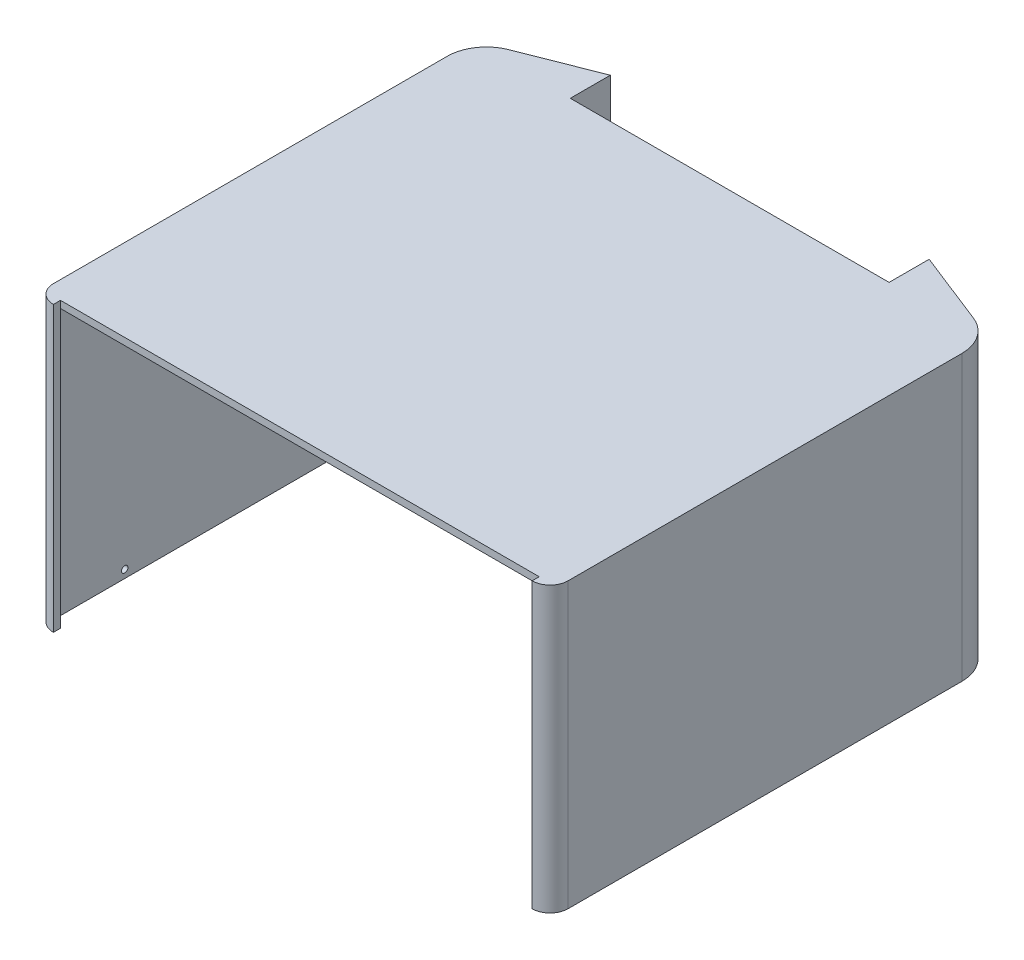
ISO-10303-21;
HEADER;
FILE_DESCRIPTION(('STEP AP214'),'2;1');
FILE_NAME('part.step','',(''),(''),'','','');
FILE_SCHEMA(('AUTOMOTIVE_DESIGN { 1 0 10303 214 1 1 1 1 }'));
ENDSEC;
DATA;
#1=APPLICATION_CONTEXT('core data for automotive mechanical design processes');
#2=APPLICATION_PROTOCOL_DEFINITION('international standard','automotive_design',2000,#1);
#3=PRODUCT_CONTEXT('',#1,'mechanical');
#4=PRODUCT('Part','Part','',(#3));
#5=PRODUCT_RELATED_PRODUCT_CATEGORY('part','',(#4));
#6=PRODUCT_DEFINITION_FORMATION('','',#4);
#7=PRODUCT_DEFINITION_CONTEXT('part definition',#1,'design');
#8=PRODUCT_DEFINITION('design','',#6,#7);
#9=PRODUCT_DEFINITION_SHAPE('','',#8);
#10=(LENGTH_UNIT() NAMED_UNIT(*) SI_UNIT(.MILLI.,.METRE.));
#11=(NAMED_UNIT(*) PLANE_ANGLE_UNIT() SI_UNIT($,.RADIAN.));
#12=(NAMED_UNIT(*) SI_UNIT($,.STERADIAN.) SOLID_ANGLE_UNIT());
#13=UNCERTAINTY_MEASURE_WITH_UNIT(LENGTH_MEASURE(1.E-05),#10,'distance_accuracy_value','');
#14=(GEOMETRIC_REPRESENTATION_CONTEXT(3) GLOBAL_UNCERTAINTY_ASSIGNED_CONTEXT((#13)) GLOBAL_UNIT_ASSIGNED_CONTEXT((#10,
#11,#12)) REPRESENTATION_CONTEXT('',''));
#15=CARTESIAN_POINT('',(0.,0.,0.));
#16=DIRECTION('',(0.,0.,1.));
#17=DIRECTION('',(1.,0.,0.));
#18=AXIS2_PLACEMENT_3D('',#15,#16,#17);
#19=CARTESIAN_POINT('',(67.4563231951163,86.2,-53.2130388353289));
#20=DIRECTION('',(0.,-1.,0.));
#21=DIRECTION('',(0.,0.,-1.));
#22=AXIS2_PLACEMENT_3D('',#19,#20,#21);
#23=PLANE('',#22);
#24=DIRECTION('',(0.,0.,-1.));
#25=VECTOR('',#24,1.);
#26=CARTESIAN_POINT('',(-52.2594055574218,86.2,-59.6605386585272));
#27=LINE('',#26,#25);
#28=CARTESIAN_POINT('',(-52.2594055574218,86.2,-59.6605386585272));
#29=VERTEX_POINT('',#28);
#30=CARTESIAN_POINT('',(-52.2594055574218,86.2,-70.2901322169009));
#31=VERTEX_POINT('',#30);
#32=EDGE_CURVE('E238',#29,#31,#27,.T.);
#33=ORIENTED_EDGE('',*,*,#32,.F.);
#34=DIRECTION('',(1.,0.,0.));
#35=VECTOR('',#34,1.);
#36=CARTESIAN_POINT('',(-51.4594055574218,86.2,-59.6605386585272));
#37=LINE('',#36,#35);
#38=CARTESIAN_POINT('',(50.5720519476544,86.2,-59.6605386585272));
#39=VERTEX_POINT('',#38);
#40=EDGE_CURVE('E64',#29,#39,#37,.T.);
#41=ORIENTED_EDGE('',*,*,#40,.T.);
#42=DIRECTION('',(0.,0.,-1.));
#43=VECTOR('',#42,1.);
#44=CARTESIAN_POINT('',(50.5720519476544,86.2,-59.6605386585272));
#45=LINE('',#44,#43);
#46=CARTESIAN_POINT('',(50.5720519476544,86.2,-70.6049959841991));
#47=VERTEX_POINT('',#46);
#48=EDGE_CURVE('E246',#39,#47,#45,.T.);
#49=ORIENTED_EDGE('',*,*,#48,.T.);
#50=DIRECTION('',(0.930522484488547,0.,0.366234768777162));
#51=VECTOR('',#50,1.);
#52=CARTESIAN_POINT('',(50.5720519476544,86.2,-70.6049959841991));
#53=LINE('',#52,#51);
#54=CARTESIAN_POINT('',(71.1186708828879,86.2,-62.5182636802143));
#55=VERTEX_POINT('',#54);
#56=EDGE_CURVE('E248',#47,#55,#53,.T.);
#57=ORIENTED_EDGE('',*,*,#56,.T.);
#58=CARTESIAN_POINT('',(67.4563231951163,86.2,-53.2130388353289));
#59=DIRECTION('',(0.,-1.,0.));
#60=DIRECTION('',(0.,0.,-1.));
#61=AXIS2_PLACEMENT_3D('',#58,#59,#60);
#62=CIRCLE('',#61,9.99999999999995);
#63=CARTESIAN_POINT('',(77.4563231951162,86.2,-53.2130388353289));
#64=VERTEX_POINT('',#63);
#65=EDGE_CURVE('E250',#55,#64,#62,.T.);
#66=ORIENTED_EDGE('',*,*,#65,.T.);
#67=DIRECTION('',(0.,0.,1.));
#68=VECTOR('',#67,1.);
#69=CARTESIAN_POINT('',(77.4563231951162,86.2,-53.2130388353289));
#70=LINE('',#69,#68);
#71=CARTESIAN_POINT('',(77.4563231951163,86.2,69.3394613414728));
#72=VERTEX_POINT('',#71);
#73=EDGE_CURVE('E252',#64,#72,#70,.T.);
#74=ORIENTED_EDGE('',*,*,#73,.T.);
#75=CARTESIAN_POINT('',(74.0563231951163,86.2,69.3394613414728));
#76=DIRECTION('',(0.,-1.,0.));
#77=DIRECTION('',(0.,0.,-1.));
#78=AXIS2_PLACEMENT_3D('',#75,#76,#77);
#79=CIRCLE('',#78,3.39999999999999);
#80=CARTESIAN_POINT('',(74.0563231951163,86.2,72.7394613414728));
#81=VERTEX_POINT('',#80);
#82=EDGE_CURVE('E254',#72,#81,#79,.T.);
#83=ORIENTED_EDGE('',*,*,#82,.T.);
#84=DIRECTION('',(-1.,0.,0.));
#85=VECTOR('',#84,1.);
#86=CARTESIAN_POINT('',(74.0563231951163,86.2,72.7394613414728));
#87=LINE('',#86,#85);
#88=CARTESIAN_POINT('',(-74.9436768048837,86.2,72.7394613414728));
#89=VERTEX_POINT('',#88);
#90=EDGE_CURVE('E257',#81,#89,#87,.T.);
#91=ORIENTED_EDGE('',*,*,#90,.T.);
#92=CARTESIAN_POINT('',(-74.9436768048837,86.2,69.3394613414728));
#93=DIRECTION('',(0.,-1.,0.));
#94=DIRECTION('',(0.,0.,-1.));
#95=AXIS2_PLACEMENT_3D('',#92,#93,#94);
#96=CIRCLE('',#95,3.4);
#97=CARTESIAN_POINT('',(-78.3436768048837,86.2,69.3394613414728));
#98=VERTEX_POINT('',#97);
#99=EDGE_CURVE('E259',#89,#98,#96,.T.);
#100=ORIENTED_EDGE('',*,*,#99,.T.);
#101=DIRECTION('',(0.,0.,-1.));
#102=VECTOR('',#101,1.);
#103=CARTESIAN_POINT('',(-78.3436768048837,86.2,69.3394613414728));
#104=LINE('',#103,#102);
#105=CARTESIAN_POINT('',(-78.3436768048837,86.2,-53.2130388353288));
#106=VERTEX_POINT('',#105);
#107=EDGE_CURVE('E261',#98,#106,#104,.T.);
#108=ORIENTED_EDGE('',*,*,#107,.T.);
#109=CARTESIAN_POINT('',(-68.3436768048837,86.2,-53.2130388353289));
#110=DIRECTION('',(0.,-1.,0.));
#111=DIRECTION('',(0.,0.,-1.));
#112=AXIS2_PLACEMENT_3D('',#109,#110,#111);
#113=CIRCLE('',#112,10.);
#114=CARTESIAN_POINT('',(-72.0060244926553,86.2,-62.5182636802143));
#115=VERTEX_POINT('',#114);
#116=EDGE_CURVE('E263',#106,#115,#113,.T.);
#117=ORIENTED_EDGE('',*,*,#116,.T.);
#118=DIRECTION('',(0.930522484488548,0.,-0.36623476877716));
#119=VECTOR('',#118,1.);
#120=CARTESIAN_POINT('',(-72.0060244926553,86.2,-62.5182636802143));
#121=LINE('',#120,#119);
#122=EDGE_CURVE('E265',#115,#31,#121,.T.);
#123=ORIENTED_EDGE('',*,*,#122,.T.);
#124=EDGE_LOOP('',(#33,#41,#49,#57,#66,#74,#83,#91,#100,#108,#117,#123));
#125=FACE_BOUND('',#124,.T.);
#126=ADVANCED_FACE('F39',(#125),#23,.T.);
#127=CARTESIAN_POINT('',(-50.0594055574218,82.,0.));
#128=DIRECTION('',(-1.,0.,0.));
#129=DIRECTION('',(0.,0.,1.));
#130=AXIS2_PLACEMENT_3D('',#127,#128,#129);
#131=PLANE('',#130);
#132=DIRECTION('',(0.,0.,1.));
#133=VECTOR('',#132,1.);
#134=CARTESIAN_POINT('',(-50.0594055574218,81.6600000000001,-61.0605386585292));
#135=LINE('',#134,#133);
#136=CARTESIAN_POINT('',(-50.0594055574218,81.6600000000001,-61.0605386585292));
#137=VERTEX_POINT('',#136);
#138=CARTESIAN_POINT('',(-50.0594055574218,81.6600000000001,-59.6605386585292));
#139=VERTEX_POINT('',#138);
#140=EDGE_CURVE('E354',#137,#139,#135,.T.);
#141=ORIENTED_EDGE('',*,*,#140,.T.);
#142=DIRECTION('',(0.,-1.,0.));
#143=VECTOR('',#142,1.);
#144=CARTESIAN_POINT('',(-50.0594055574218,96.9,-59.6605386585272));
#145=LINE('',#144,#143);
#146=CARTESIAN_POINT('',(-50.0594055574218,0.,-59.6605386585272));
#147=VERTEX_POINT('',#146);
#148=EDGE_CURVE('E43',#139,#147,#145,.T.);
#149=ORIENTED_EDGE('',*,*,#148,.T.);
#150=DIRECTION('',(0.,0.,-1.));
#151=VECTOR('',#150,1.);
#152=CARTESIAN_POINT('',(-50.0594055574218,0.,0.));
#153=LINE('',#152,#151);
#154=CARTESIAN_POINT('',(-50.0594055574218,0.,-73.5202707051308));
#155=VERTEX_POINT('',#154);
#156=EDGE_CURVE('E227',#147,#155,#153,.T.);
#157=ORIENTED_EDGE('',*,*,#156,.T.);
#158=DIRECTION('',(0.,1.,0.));
#159=VECTOR('',#158,1.);
#160=CARTESIAN_POINT('',(-50.0594055574218,-151.557193273161,-73.5202707051308));
#161=LINE('',#160,#159);
#162=CARTESIAN_POINT('',(-50.0594055574218,88.4,-73.5202707051308));
#163=VERTEX_POINT('',#162);
#164=EDGE_CURVE('E291',#155,#163,#161,.T.);
#165=ORIENTED_EDGE('',*,*,#164,.T.);
#166=DIRECTION('',(0.,0.,-1.));
#167=VECTOR('',#166,1.);
#168=CARTESIAN_POINT('',(-50.0594055574218,88.4,0.));
#169=LINE('',#168,#167);
#170=CARTESIAN_POINT('',(-50.0594055574218,88.4,-61.0605386585292));
#171=VERTEX_POINT('',#170);
#172=EDGE_CURVE('E403',#171,#163,#169,.T.);
#173=ORIENTED_EDGE('',*,*,#172,.F.);
#174=DIRECTION('',(0.,-1.,0.));
#175=VECTOR('',#174,1.);
#176=CARTESIAN_POINT('',(-50.0594055574218,0.,-61.0605386585292));
#177=LINE('',#176,#175);
#178=EDGE_CURVE('E345',#171,#137,#177,.T.);
#179=ORIENTED_EDGE('',*,*,#178,.T.);
#180=EDGE_LOOP('',(#141,#149,#157,#165,#173,#179));
#181=FACE_BOUND('',#180,.T.);
#182=ADVANCED_FACE('F462',(#181),#131,.F.);
#183=CARTESIAN_POINT('',(49.1720519476544,88.4,0.));
#184=DIRECTION('',(1.,0.,0.));
#185=DIRECTION('',(0.,0.,-1.));
#186=AXIS2_PLACEMENT_3D('',#183,#184,#185);
#187=PLANE('',#186);
#188=DIRECTION('',(0.,0.,1.));
#189=VECTOR('',#188,1.);
#190=CARTESIAN_POINT('',(49.1720519476541,81.66,-61.0605386585272));
#191=LINE('',#190,#189);
#192=CARTESIAN_POINT('',(49.1720519476541,81.66,-61.0605386585272));
#193=VERTEX_POINT('',#192);
#194=CARTESIAN_POINT('',(49.1720519476544,81.66,-59.6605386585272));
#195=VERTEX_POINT('',#194);
#196=EDGE_CURVE('E358',#193,#195,#191,.T.);
#197=ORIENTED_EDGE('',*,*,#196,.F.);
#198=DIRECTION('',(0.,-1.,0.));
#199=VECTOR('',#198,1.);
#200=CARTESIAN_POINT('',(49.1720519476509,-1.92367756039792E-12,-61.0605386585272));
#201=LINE('',#200,#199);
#202=CARTESIAN_POINT('',(49.1720519476544,88.4,-61.0605386585272));
#203=VERTEX_POINT('',#202);
#204=EDGE_CURVE('E350',#203,#193,#201,.T.);
#205=ORIENTED_EDGE('',*,*,#204,.F.);
#206=DIRECTION('',(0.,0.,1.));
#207=VECTOR('',#206,1.);
#208=CARTESIAN_POINT('',(49.1720519476544,88.4,0.));
#209=LINE('',#208,#207);
#210=CARTESIAN_POINT('',(49.1720519476544,88.4,-73.5202707051308));
#211=VERTEX_POINT('',#210);
#212=EDGE_CURVE('E413',#211,#203,#209,.T.);
#213=ORIENTED_EDGE('',*,*,#212,.F.);
#214=DIRECTION('',(0.,1.,0.));
#215=VECTOR('',#214,1.);
#216=CARTESIAN_POINT('',(49.1720519476544,-151.557193273161,-73.5202707051308));
#217=LINE('',#216,#215);
#218=CARTESIAN_POINT('',(49.1720519476544,0.,-73.5202707051308));
#219=VERTEX_POINT('',#218);
#220=EDGE_CURVE('E331',#219,#211,#217,.T.);
#221=ORIENTED_EDGE('',*,*,#220,.F.);
#222=DIRECTION('',(0.,0.,-1.));
#223=VECTOR('',#222,1.);
#224=CARTESIAN_POINT('',(49.1720519476544,0.,0.));
#225=LINE('',#224,#223);
#226=CARTESIAN_POINT('',(49.1720519476544,0.,-59.6605386585272));
#227=VERTEX_POINT('',#226);
#228=EDGE_CURVE('E375',#227,#219,#225,.T.);
#229=ORIENTED_EDGE('',*,*,#228,.F.);
#230=DIRECTION('',(0.,-1.,0.));
#231=VECTOR('',#230,1.);
#232=CARTESIAN_POINT('',(49.1720519476544,82.,-59.6605386585272));
#233=LINE('',#232,#231);
#234=EDGE_CURVE('E397',#195,#227,#233,.T.);
#235=ORIENTED_EDGE('',*,*,#234,.F.);
#236=EDGE_LOOP('',(#197,#205,#213,#221,#229,#235));
#237=FACE_BOUND('',#236,.T.);
#238=ADVANCED_FACE('F468',(#237),#187,.F.);
#239=CARTESIAN_POINT('',(0.,0.,0.));
#240=DIRECTION('',(0.,1.,0.));
#241=DIRECTION('',(0.,0.,1.));
#242=AXIS2_PLACEMENT_3D('',#239,#240,#241);
#243=PLANE('',#242);
#244=DIRECTION('',(0.,0.,1.));
#245=VECTOR('',#244,1.);
#246=CARTESIAN_POINT('',(-52.2594055574218,0.,-70.6049959841991));
#247=LINE('',#246,#245);
#248=CARTESIAN_POINT('',(-52.2594055574218,0.,-70.2901322169009));
#249=VERTEX_POINT('',#248);
#250=CARTESIAN_POINT('',(-52.2594055574218,0.,-59.6605386585272));
#251=VERTEX_POINT('',#250);
#252=EDGE_CURVE('E225',#249,#251,#247,.T.);
#253=ORIENTED_EDGE('',*,*,#252,.F.);
#254=DIRECTION('',(0.930522484488547,0.,-0.366234768777162));
#255=VECTOR('',#254,1.);
#256=CARTESIAN_POINT('',(-30.9635967827457,0.,-78.6717304399712));
#257=LINE('',#256,#255);
#258=CARTESIAN_POINT('',(-72.0060244926553,0.,-62.5182636802143));
#259=VERTEX_POINT('',#258);
#260=EDGE_CURVE('E56',#259,#249,#257,.T.);
#261=ORIENTED_EDGE('',*,*,#260,.F.);
#262=CARTESIAN_POINT('',(-68.3436768048837,0.,-53.2130388353289));
#263=DIRECTION('',(0.,1.,0.));
#264=DIRECTION('',(0.,0.,1.));
#265=AXIS2_PLACEMENT_3D('',#262,#263,#264);
#266=CIRCLE('',#265,9.99999999999998);
#267=CARTESIAN_POINT('',(-78.3436768048837,0.,-53.2130388353288));
#268=VERTEX_POINT('',#267);
#269=EDGE_CURVE('E427',#268,#259,#266,.F.);
#270=ORIENTED_EDGE('',*,*,#269,.F.);
#271=DIRECTION('',(0.,0.,1.));
#272=VECTOR('',#271,1.);
#273=CARTESIAN_POINT('',(-78.3436768048837,0.,0.));
#274=LINE('',#273,#272);
#275=CARTESIAN_POINT('',(-78.3436768048837,0.,69.3394613414728));
#276=VERTEX_POINT('',#275);
#277=EDGE_CURVE('E229',#268,#276,#274,.T.);
#278=ORIENTED_EDGE('',*,*,#277,.T.);
#279=CARTESIAN_POINT('',(-74.9436768048837,0.,69.3394613414728));
#280=DIRECTION('',(0.,1.,0.));
#281=DIRECTION('',(0.,0.,1.));
#282=AXIS2_PLACEMENT_3D('',#279,#280,#281);
#283=CIRCLE('',#282,3.4);
#284=CARTESIAN_POINT('',(-74.9436768048837,0.,72.7394613414728));
#285=VERTEX_POINT('',#284);
#286=EDGE_CURVE('E418',#276,#285,#283,.T.);
#287=ORIENTED_EDGE('',*,*,#286,.T.);
#288=DIRECTION('',(0.,0.,1.));
#289=VECTOR('',#288,1.);
#290=CARTESIAN_POINT('',(-74.9436768048837,0.,72.6394613414728));
#291=LINE('',#290,#289);
#292=CARTESIAN_POINT('',(-74.9436768048837,0.,74.9394613414728));
#293=VERTEX_POINT('',#292);
#294=EDGE_CURVE('E230',#285,#293,#291,.T.);
#295=ORIENTED_EDGE('',*,*,#294,.T.);
#296=CARTESIAN_POINT('',(-74.9436768048837,0.,69.3394613414728));
#297=DIRECTION('',(0.,1.,0.));
#298=DIRECTION('',(0.,0.,1.));
#299=AXIS2_PLACEMENT_3D('',#296,#297,#298);
#300=CIRCLE('',#299,5.6);
#301=CARTESIAN_POINT('',(-80.5436768048837,0.,69.3394613414728));
#302=VERTEX_POINT('',#301);
#303=EDGE_CURVE('E275',#293,#302,#300,.F.);
#304=ORIENTED_EDGE('',*,*,#303,.T.);
#305=DIRECTION('',(0.,0.,-1.));
#306=VECTOR('',#305,1.);
#307=CARTESIAN_POINT('',(-80.5436768048837,0.,0.));
#308=LINE('',#307,#306);
#309=CARTESIAN_POINT('',(-80.5436768048837,0.,-53.2130388353288));
#310=VERTEX_POINT('',#309);
#311=EDGE_CURVE('E273',#302,#310,#308,.T.);
#312=ORIENTED_EDGE('',*,*,#311,.T.);
#313=CARTESIAN_POINT('',(-68.3436768048837,0.,-53.2130388353289));
#314=DIRECTION('',(0.,1.,0.));
#315=DIRECTION('',(0.,0.,1.));
#316=AXIS2_PLACEMENT_3D('',#313,#314,#315);
#317=CIRCLE('',#316,12.2);
#318=CARTESIAN_POINT('',(-72.8117409839651,0.,-64.5654131460891));
#319=VERTEX_POINT('',#318);
#320=EDGE_CURVE('E270',#310,#319,#317,.F.);
#321=ORIENTED_EDGE('',*,*,#320,.T.);
#322=DIRECTION('',(0.930522484488548,0.,-0.366234768777161));
#323=VECTOR('',#322,1.);
#324=CARTESIAN_POINT('',(-31.7693132740553,0.,-80.718879905846));
#325=LINE('',#324,#323);
#326=EDGE_CURVE('E268',#319,#155,#325,.T.);
#327=ORIENTED_EDGE('',*,*,#326,.T.);
#328=ORIENTED_EDGE('',*,*,#156,.F.);
#329=DIRECTION('',(-1.,0.,0.));
#330=VECTOR('',#329,1.);
#331=CARTESIAN_POINT('',(0.,0.,-59.6605386585272));
#332=LINE('',#331,#330);
#333=EDGE_CURVE('E223',#147,#251,#332,.T.);
#334=ORIENTED_EDGE('',*,*,#333,.T.);
#335=EDGE_LOOP('',(#253,#261,#270,#278,#287,#295,#304,#312,#321,#327,#328,#334));
#336=FACE_BOUND('',#335,.T.);
#337=ADVANCED_FACE('F41',(#336),#243,.F.);
#338=CARTESIAN_POINT('',(-74.9436768048837,82.,69.3394613414728));
#339=DIRECTION('',(0.,-1.,0.));
#340=DIRECTION('',(0.,0.,-1.));
#341=AXIS2_PLACEMENT_3D('',#338,#339,#340);
#342=CYLINDRICAL_SURFACE('',#341,3.4);
#343=ORIENTED_EDGE('',*,*,#99,.F.);
#344=DIRECTION('',(0.,-1.,0.));
#345=VECTOR('',#344,1.);
#346=CARTESIAN_POINT('',(-74.9436768048837,82.,72.7394613414728));
#347=LINE('',#346,#345);
#348=EDGE_CURVE('E423',#89,#285,#347,.T.);
#349=ORIENTED_EDGE('',*,*,#348,.T.);
#350=ORIENTED_EDGE('',*,*,#286,.F.);
#351=DIRECTION('',(0.,-1.,0.));
#352=VECTOR('',#351,1.);
#353=CARTESIAN_POINT('',(-78.3436768048837,82.,69.3394613414728));
#354=LINE('',#353,#352);
#355=EDGE_CURVE('E422',#98,#276,#354,.T.);
#356=ORIENTED_EDGE('',*,*,#355,.F.);
#357=EDGE_LOOP('',(#343,#349,#350,#356));
#358=FACE_BOUND('',#357,.T.);
#359=ADVANCED_FACE('F447',(#358),#342,.F.);
#360=CARTESIAN_POINT('',(-78.3436768048837,82.,0.));
#361=DIRECTION('',(1.,0.,0.));
#362=DIRECTION('',(0.,0.,-1.));
#363=AXIS2_PLACEMENT_3D('',#360,#361,#362);
#364=PLANE('',#363);
#365=ORIENTED_EDGE('',*,*,#107,.F.);
#366=ORIENTED_EDGE('',*,*,#355,.T.);
#367=ORIENTED_EDGE('',*,*,#277,.F.);
#368=DIRECTION('',(0.,-1.,0.));
#369=VECTOR('',#368,1.);
#370=CARTESIAN_POINT('',(-78.3436768048837,82.,-53.2130388353288));
#371=LINE('',#370,#369);
#372=EDGE_CURVE('E425',#106,#268,#371,.T.);
#373=ORIENTED_EDGE('',*,*,#372,.F.);
#374=EDGE_LOOP('',(#365,#366,#367,#373));
#375=FACE_BOUND('',#374,.T.);
#376=CARTESIAN_POINT('',(-78.3436768048837,2.5,-33.2130388353288));
#377=DIRECTION('',(1.,0.,0.));
#378=DIRECTION('',(0.,0.,-1.));
#379=AXIS2_PLACEMENT_3D('',#376,#377,#378);
#380=CIRCLE('',#379,0.999999999999998);
#381=CARTESIAN_POINT('',(-78.3436768048837,2.5,-34.2130388353288));
#382=VERTEX_POINT('',#381);
#383=EDGE_CURVE('E11',#382,#382,#380,.T.);
#384=ORIENTED_EDGE('',*,*,#383,.F.);
#385=EDGE_LOOP('',(#384));
#386=FACE_BOUND('',#385,.T.);
#387=CARTESIAN_POINT('',(-78.3436768048837,2.5,49.3394613414728));
#388=DIRECTION('',(1.,0.,0.));
#389=DIRECTION('',(0.,0.,-1.));
#390=AXIS2_PLACEMENT_3D('',#387,#388,#389);
#391=CIRCLE('',#390,0.999999999999998);
#392=CARTESIAN_POINT('',(-78.3436768048837,2.5,48.3394613414728));
#393=VERTEX_POINT('',#392);
#394=EDGE_CURVE('E48',#393,#393,#391,.T.);
#395=ORIENTED_EDGE('',*,*,#394,.F.);
#396=EDGE_LOOP('',(#395));
#397=FACE_BOUND('',#396,.T.);
#398=ADVANCED_FACE('F444',(#375,#386,#397),#364,.T.);
#399=CARTESIAN_POINT('',(-68.3436768048837,82.,-53.2130388353289));
#400=DIRECTION('',(0.,-1.,0.));
#401=DIRECTION('',(0.,0.,-1.));
#402=AXIS2_PLACEMENT_3D('',#399,#400,#401);
#403=CYLINDRICAL_SURFACE('',#402,9.99999999999998);
#404=DIRECTION('',(0.,-1.,0.));
#405=VECTOR('',#404,1.);
#406=CARTESIAN_POINT('',(-72.0060244926553,82.,-62.5182636802143));
#407=LINE('',#406,#405);
#408=EDGE_CURVE('E428',#115,#259,#407,.T.);
#409=ORIENTED_EDGE('',*,*,#408,.F.);
#410=ORIENTED_EDGE('',*,*,#116,.F.);
#411=ORIENTED_EDGE('',*,*,#372,.T.);
#412=ORIENTED_EDGE('',*,*,#269,.T.);
#413=EDGE_LOOP('',(#409,#410,#411,#412));
#414=FACE_BOUND('',#413,.T.);
#415=ADVANCED_FACE('F446',(#414),#403,.F.);
#416=CARTESIAN_POINT('',(-30.9635967827457,82.,-78.6717304399712));
#417=DIRECTION('',(-0.366234768777162,0.,-0.930522484488547));
#418=DIRECTION('',(-0.930522484488547,0.,0.366234768777162));
#419=AXIS2_PLACEMENT_3D('',#416,#417,#418);
#420=PLANE('',#419);
#421=ORIENTED_EDGE('',*,*,#260,.T.);
#422=DIRECTION('',(0.,1.,0.));
#423=VECTOR('',#422,1.);
#424=CARTESIAN_POINT('',(-52.2594055574218,82.,-70.2901322169009));
#425=LINE('',#424,#423);
#426=EDGE_CURVE('E237',#249,#31,#425,.T.);
#427=ORIENTED_EDGE('',*,*,#426,.T.);
#428=ORIENTED_EDGE('',*,*,#122,.F.);
#429=ORIENTED_EDGE('',*,*,#408,.T.);
#430=EDGE_LOOP('',(#421,#427,#428,#429));
#431=FACE_BOUND('',#430,.T.);
#432=ADVANCED_FACE('F454',(#431),#420,.F.);
#433=CARTESIAN_POINT('',(0.,82.,-59.6605386585272));
#434=DIRECTION('',(0.,0.,1.));
#435=DIRECTION('',(1.,0.,0.));
#436=AXIS2_PLACEMENT_3D('',#433,#434,#435);
#437=PLANE('',#436);
#438=ORIENTED_EDGE('',*,*,#40,.F.);
#439=DIRECTION('',(0.,1.,0.));
#440=VECTOR('',#439,1.);
#441=CARTESIAN_POINT('',(-52.2594055574218,0.,-59.6605386585272));
#442=LINE('',#441,#440);
#443=EDGE_CURVE('E236',#251,#29,#442,.T.);
#444=ORIENTED_EDGE('',*,*,#443,.F.);
#445=ORIENTED_EDGE('',*,*,#333,.F.);
#446=ORIENTED_EDGE('',*,*,#148,.F.);
#447=DIRECTION('',(-1.,0.,0.));
#448=VECTOR('',#447,1.);
#449=CARTESIAN_POINT('',(1.21471754603014E-12,81.66,-59.6605386585282));
#450=LINE('',#449,#448);
#451=EDGE_CURVE('E344',#195,#139,#450,.T.);
#452=ORIENTED_EDGE('',*,*,#451,.F.);
#453=ORIENTED_EDGE('',*,*,#234,.T.);
#454=DIRECTION('',(1.,0.,0.));
#455=VECTOR('',#454,1.);
#456=CARTESIAN_POINT('',(0.,0.,-59.6605386585272));
#457=LINE('',#456,#455);
#458=CARTESIAN_POINT('',(50.5720519476544,0.,-59.6605386585272));
#459=VERTEX_POINT('',#458);
#460=EDGE_CURVE('E377',#227,#459,#457,.T.);
#461=ORIENTED_EDGE('',*,*,#460,.T.);
#462=DIRECTION('',(0.,-1.,0.));
#463=VECTOR('',#462,1.);
#464=CARTESIAN_POINT('',(50.5720519476544,82.,-59.6605386585272));
#465=LINE('',#464,#463);
#466=EDGE_CURVE('E395',#39,#459,#465,.T.);
#467=ORIENTED_EDGE('',*,*,#466,.F.);
#468=EDGE_LOOP('',(#438,#444,#445,#446,#452,#453,#461,#467));
#469=FACE_BOUND('',#468,.T.);
#470=ADVANCED_FACE('F240',(#469),#437,.T.);
#471=CARTESIAN_POINT('',(-74.9436768048837,82.,72.6394613414728));
#472=DIRECTION('',(-1.,0.,0.));
#473=DIRECTION('',(0.,0.,1.));
#474=AXIS2_PLACEMENT_3D('',#471,#472,#473);
#475=PLANE('',#474);
#476=CARTESIAN_POINT('',(-74.9436768048837,88.4,72.7394613414728));
#477=VERTEX_POINT('',#476);
#478=EDGE_CURVE('E419',#477,#89,#347,.T.);
#479=ORIENTED_EDGE('',*,*,#478,.F.);
#480=DIRECTION('',(0.,0.,-1.));
#481=VECTOR('',#480,1.);
#482=CARTESIAN_POINT('',(-74.9436768048837,88.4,0.));
#483=LINE('',#482,#481);
#484=CARTESIAN_POINT('',(-74.9436768048837,88.4,74.9394613414728));
#485=VERTEX_POINT('',#484);
#486=EDGE_CURVE('E405',#485,#477,#483,.T.);
#487=ORIENTED_EDGE('',*,*,#486,.F.);
#488=DIRECTION('',(0.,1.,0.));
#489=VECTOR('',#488,1.);
#490=CARTESIAN_POINT('',(-74.9436768048837,-151.557193273161,74.9394613414728));
#491=LINE('',#490,#489);
#492=EDGE_CURVE('E294',#293,#485,#491,.T.);
#493=ORIENTED_EDGE('',*,*,#492,.F.);
#494=ORIENTED_EDGE('',*,*,#294,.F.);
#495=ORIENTED_EDGE('',*,*,#348,.F.);
#496=EDGE_LOOP('',(#479,#487,#493,#494,#495));
#497=FACE_BOUND('',#496,.T.);
#498=ADVANCED_FACE('F581',(#497),#475,.F.);
#499=CARTESIAN_POINT('',(163.256323195116,2.5,49.3394613414728));
#500=DIRECTION('',(-1.,0.,0.));
#501=DIRECTION('',(0.,0.,1.));
#502=AXIS2_PLACEMENT_3D('',#499,#500,#501);
#503=CYLINDRICAL_SURFACE('',#502,0.999999999999998);
#504=ORIENTED_EDGE('',*,*,#394,.T.);
#505=EDGE_LOOP('',(#504));
#506=FACE_BOUND('',#505,.T.);
#507=CARTESIAN_POINT('',(-79.7436768048837,2.5,49.3394613414728));
#508=DIRECTION('',(-1.,0.,0.));
#509=DIRECTION('',(0.,0.,1.));
#510=AXIS2_PLACEMENT_3D('',#507,#508,#509);
#511=CIRCLE('',#510,0.999999999999998);
#512=CARTESIAN_POINT('',(-79.7436768048837,2.5,50.3394613414728));
#513=VERTEX_POINT('',#512);
#514=EDGE_CURVE('E302',#513,#513,#511,.F.);
#515=ORIENTED_EDGE('',*,*,#514,.F.);
#516=EDGE_LOOP('',(#515));
#517=FACE_BOUND('',#516,.T.);
#518=ADVANCED_FACE('F441',(#506,#517),#503,.F.);
#519=CARTESIAN_POINT('',(163.256323195116,2.5,-33.2130388353288));
#520=DIRECTION('',(-1.,0.,0.));
#521=DIRECTION('',(0.,0.,1.));
#522=AXIS2_PLACEMENT_3D('',#519,#520,#521);
#523=CYLINDRICAL_SURFACE('',#522,0.999999999999998);
#524=ORIENTED_EDGE('',*,*,#383,.T.);
#525=EDGE_LOOP('',(#524));
#526=FACE_BOUND('',#525,.T.);
#527=CARTESIAN_POINT('',(-79.7436768048837,2.5,-33.2130388353288));
#528=DIRECTION('',(-1.,0.,0.));
#529=DIRECTION('',(0.,0.,1.));
#530=AXIS2_PLACEMENT_3D('',#527,#528,#529);
#531=CIRCLE('',#530,0.999999999999998);
#532=CARTESIAN_POINT('',(-79.7436768048837,2.5,-32.2130388353288));
#533=VERTEX_POINT('',#532);
#534=EDGE_CURVE('E299',#533,#533,#531,.F.);
#535=ORIENTED_EDGE('',*,*,#534,.F.);
#536=EDGE_LOOP('',(#535));
#537=FACE_BOUND('',#536,.T.);
#538=ADVANCED_FACE('F568',(#526,#537),#523,.F.);
#539=CARTESIAN_POINT('',(0.,88.4,72.7394613414728));
#540=DIRECTION('',(0.,0.,1.));
#541=DIRECTION('',(1.,0.,0.));
#542=AXIS2_PLACEMENT_3D('',#539,#540,#541);
#543=PLANE('',#542);
#544=DIRECTION('',(-1.,0.,0.));
#545=VECTOR('',#544,1.);
#546=CARTESIAN_POINT('',(0.,88.4,72.7394613414728));
#547=LINE('',#546,#545);
#548=CARTESIAN_POINT('',(74.0563231951163,88.4,72.7394613414728));
#549=VERTEX_POINT('',#548);
#550=EDGE_CURVE('E408',#549,#477,#547,.T.);
#551=ORIENTED_EDGE('',*,*,#550,.T.);
#552=ORIENTED_EDGE('',*,*,#478,.T.);
#553=ORIENTED_EDGE('',*,*,#90,.F.);
#554=DIRECTION('',(0.,-1.,0.));
#555=VECTOR('',#554,1.);
#556=CARTESIAN_POINT('',(74.0563231951163,88.4,72.7394613414728));
#557=LINE('',#556,#555);
#558=EDGE_CURVE('E416',#549,#81,#557,.T.);
#559=ORIENTED_EDGE('',*,*,#558,.F.);
#560=EDGE_LOOP('',(#551,#552,#553,#559));
#561=FACE_BOUND('',#560,.T.);
#562=ADVANCED_FACE('F565',(#561),#543,.T.);
#563=CARTESIAN_POINT('',(74.0563231951163,88.4,0.));
#564=DIRECTION('',(1.,0.,0.));
#565=DIRECTION('',(0.,0.,-1.));
#566=AXIS2_PLACEMENT_3D('',#563,#564,#565);
#567=PLANE('',#566);
#568=ORIENTED_EDGE('',*,*,#558,.T.);
#569=DIRECTION('',(0.,-1.,0.));
#570=VECTOR('',#569,1.);
#571=CARTESIAN_POINT('',(74.0563231951163,82.,72.7394613414728));
#572=LINE('',#571,#570);
#573=CARTESIAN_POINT('',(74.0563231951163,0.,72.7394613414728));
#574=VERTEX_POINT('',#573);
#575=EDGE_CURVE('E399',#81,#574,#572,.T.);
#576=ORIENTED_EDGE('',*,*,#575,.T.);
#577=DIRECTION('',(0.,0.,1.));
#578=VECTOR('',#577,1.);
#579=CARTESIAN_POINT('',(74.0563231951163,0.,72.6394613414728));
#580=LINE('',#579,#578);
#581=CARTESIAN_POINT('',(74.0563231951163,0.,74.9394613414728));
#582=VERTEX_POINT('',#581);
#583=EDGE_CURVE('E367',#574,#582,#580,.T.);
#584=ORIENTED_EDGE('',*,*,#583,.T.);
#585=DIRECTION('',(0.,1.,0.));
#586=VECTOR('',#585,1.);
#587=CARTESIAN_POINT('',(74.0563231951163,-151.557193273161,74.9394613414728));
#588=LINE('',#587,#586);
#589=CARTESIAN_POINT('',(74.0563231951163,88.4,74.9394613414728));
#590=VERTEX_POINT('',#589);
#591=EDGE_CURVE('E328',#582,#590,#588,.T.);
#592=ORIENTED_EDGE('',*,*,#591,.T.);
#593=DIRECTION('',(0.,0.,1.));
#594=VECTOR('',#593,1.);
#595=CARTESIAN_POINT('',(74.0563231951163,88.4,0.));
#596=LINE('',#595,#594);
#597=EDGE_CURVE('E411',#549,#590,#596,.T.);
#598=ORIENTED_EDGE('',*,*,#597,.F.);
#599=EDGE_LOOP('',(#568,#576,#584,#592,#598));
#600=FACE_BOUND('',#599,.T.);
#601=ADVANCED_FACE('F558',(#600),#567,.F.);
#602=CARTESIAN_POINT('',(0.,88.4,0.));
#603=DIRECTION('',(0.,1.,0.));
#604=DIRECTION('',(0.,0.,1.));
#605=AXIS2_PLACEMENT_3D('',#602,#603,#604);
#606=PLANE('',#605);
#607=DIRECTION('',(1.,0.,0.));
#608=VECTOR('',#607,1.);
#609=CARTESIAN_POINT('',(1.20821200583998E-12,88.4,-61.0605386585282));
#610=LINE('',#609,#608);
#611=EDGE_CURVE('E348',#171,#203,#610,.T.);
#612=ORIENTED_EDGE('',*,*,#611,.F.);
#613=ORIENTED_EDGE('',*,*,#172,.T.);
#614=DIRECTION('',(-0.930522484488548,0.,0.366234768777161));
#615=VECTOR('',#614,1.);
#616=CARTESIAN_POINT('',(-31.7693132740553,88.4,-80.718879905846));
#617=LINE('',#616,#615);
#618=CARTESIAN_POINT('',(-72.8117409839651,88.4,-64.5654131460891));
#619=VERTEX_POINT('',#618);
#620=EDGE_CURVE('E281',#163,#619,#617,.T.);
#621=ORIENTED_EDGE('',*,*,#620,.T.);
#622=CARTESIAN_POINT('',(-68.3436768048837,88.4,-53.2130388353289));
#623=DIRECTION('',(0.,1.,0.));
#624=DIRECTION('',(0.,0.,1.));
#625=AXIS2_PLACEMENT_3D('',#622,#623,#624);
#626=CIRCLE('',#625,12.2);
#627=CARTESIAN_POINT('',(-80.5436768048837,88.4,-53.2130388353288));
#628=VERTEX_POINT('',#627);
#629=EDGE_CURVE('E284',#619,#628,#626,.T.);
#630=ORIENTED_EDGE('',*,*,#629,.T.);
#631=DIRECTION('',(0.,0.,1.));
#632=VECTOR('',#631,1.);
#633=CARTESIAN_POINT('',(-80.5436768048837,88.4,0.));
#634=LINE('',#633,#632);
#635=CARTESIAN_POINT('',(-80.5436768048837,88.4,69.3394613414728));
#636=VERTEX_POINT('',#635);
#637=EDGE_CURVE('E267',#628,#636,#634,.T.);
#638=ORIENTED_EDGE('',*,*,#637,.T.);
#639=CARTESIAN_POINT('',(-74.9436768048837,88.4,69.3394613414728));
#640=DIRECTION('',(0.,1.,0.));
#641=DIRECTION('',(0.,0.,1.));
#642=AXIS2_PLACEMENT_3D('',#639,#640,#641);
#643=CIRCLE('',#642,5.6);
#644=EDGE_CURVE('E278',#636,#485,#643,.T.);
#645=ORIENTED_EDGE('',*,*,#644,.T.);
#646=ORIENTED_EDGE('',*,*,#486,.T.);
#647=ORIENTED_EDGE('',*,*,#550,.F.);
#648=ORIENTED_EDGE('',*,*,#597,.T.);
#649=CARTESIAN_POINT('',(74.0563231951163,88.4,69.3394613414728));
#650=DIRECTION('',(0.,1.,0.));
#651=DIRECTION('',(0.,0.,1.));
#652=AXIS2_PLACEMENT_3D('',#649,#650,#651);
#653=CIRCLE('',#652,5.6);
#654=CARTESIAN_POINT('',(79.6563231951163,88.4,69.3394613414728));
#655=VERTEX_POINT('',#654);
#656=EDGE_CURVE('E323',#590,#655,#653,.T.);
#657=ORIENTED_EDGE('',*,*,#656,.T.);
#658=DIRECTION('',(0.,0.,-1.));
#659=VECTOR('',#658,1.);
#660=CARTESIAN_POINT('',(79.6563231951163,88.4,0.));
#661=LINE('',#660,#659);
#662=CARTESIAN_POINT('',(79.6563231951163,88.4,-53.2130388353288));
#663=VERTEX_POINT('',#662);
#664=EDGE_CURVE('E305',#655,#663,#661,.T.);
#665=ORIENTED_EDGE('',*,*,#664,.T.);
#666=CARTESIAN_POINT('',(67.4563231951163,88.4,-53.2130388353289));
#667=DIRECTION('',(0.,1.,0.));
#668=DIRECTION('',(0.,0.,1.));
#669=AXIS2_PLACEMENT_3D('',#666,#667,#668);
#670=CIRCLE('',#669,12.2);
#671=CARTESIAN_POINT('',(71.9243873741977,88.4,-64.5654131460891));
#672=VERTEX_POINT('',#671);
#673=EDGE_CURVE('E317',#663,#672,#670,.T.);
#674=ORIENTED_EDGE('',*,*,#673,.T.);
#675=DIRECTION('',(-0.930522484488548,0.,-0.366234768777161));
#676=VECTOR('',#675,1.);
#677=CARTESIAN_POINT('',(31.6502943926187,88.4,-80.4164789469607));
#678=LINE('',#677,#676);
#679=EDGE_CURVE('E320',#672,#211,#678,.T.);
#680=ORIENTED_EDGE('',*,*,#679,.T.);
#681=ORIENTED_EDGE('',*,*,#212,.T.);
#682=EDGE_LOOP('',(#612,#613,#621,#630,#638,#645,#646,#647,#648,#657,#665,#674,#680,#681));
#683=FACE_BOUND('',#682,.T.);
#684=ADVANCED_FACE('F532',(#683),#606,.T.);
#685=CARTESIAN_POINT('',(163.256323195116,2.5,49.3394613414728));
#686=DIRECTION('',(-1.,0.,0.));
#687=DIRECTION('',(0.,0.,1.));
#688=AXIS2_PLACEMENT_3D('',#685,#686,#687);
#689=CYLINDRICAL_SURFACE('',#688,0.999999999999998);
#690=CARTESIAN_POINT('',(78.8563231951163,2.5,49.3394613414728));
#691=DIRECTION('',(1.,0.,0.));
#692=DIRECTION('',(0.,0.,-1.));
#693=AXIS2_PLACEMENT_3D('',#690,#691,#692);
#694=CIRCLE('',#693,0.999999999999998);
#695=CARTESIAN_POINT('',(78.8563231951163,2.5,48.3394613414728));
#696=VERTEX_POINT('',#695);
#697=EDGE_CURVE('E341',#696,#696,#694,.F.);
#698=ORIENTED_EDGE('',*,*,#697,.F.);
#699=EDGE_LOOP('',(#698));
#700=FACE_BOUND('',#699,.T.);
#701=CARTESIAN_POINT('',(77.4563231951163,2.5,49.3394613414728));
#702=DIRECTION('',(1.,0.,0.));
#703=DIRECTION('',(0.,0.,-1.));
#704=AXIS2_PLACEMENT_3D('',#701,#702,#703);
#705=CIRCLE('',#704,0.999999999999998);
#706=CARTESIAN_POINT('',(77.4563231951163,2.5,48.3394613414728));
#707=VERTEX_POINT('',#706);
#708=EDGE_CURVE('E361',#707,#707,#705,.T.);
#709=ORIENTED_EDGE('',*,*,#708,.F.);
#710=EDGE_LOOP('',(#709));
#711=FACE_BOUND('',#710,.T.);
#712=ADVANCED_FACE('F528',(#700,#711),#689,.F.);
#713=CARTESIAN_POINT('',(163.256323195116,2.5,-33.2130388353288));
#714=DIRECTION('',(-1.,0.,0.));
#715=DIRECTION('',(0.,0.,1.));
#716=AXIS2_PLACEMENT_3D('',#713,#714,#715);
#717=CYLINDRICAL_SURFACE('',#716,0.999999999999998);
#718=CARTESIAN_POINT('',(78.8563231951163,2.5,-33.2130388353288));
#719=DIRECTION('',(1.,0.,0.));
#720=DIRECTION('',(0.,0.,-1.));
#721=AXIS2_PLACEMENT_3D('',#718,#719,#720);
#722=CIRCLE('',#721,0.999999999999998);
#723=CARTESIAN_POINT('',(78.8563231951163,2.5,-34.2130388353288));
#724=VERTEX_POINT('',#723);
#725=EDGE_CURVE('E338',#724,#724,#722,.F.);
#726=ORIENTED_EDGE('',*,*,#725,.F.);
#727=EDGE_LOOP('',(#726));
#728=FACE_BOUND('',#727,.T.);
#729=CARTESIAN_POINT('',(77.4563231951163,2.5,-33.2130388353288));
#730=DIRECTION('',(1.,0.,0.));
#731=DIRECTION('',(0.,0.,-1.));
#732=AXIS2_PLACEMENT_3D('',#729,#730,#731);
#733=CIRCLE('',#732,0.999999999999998);
#734=CARTESIAN_POINT('',(77.4563231951163,2.5,-34.2130388353288));
#735=VERTEX_POINT('',#734);
#736=EDGE_CURVE('E364',#735,#735,#733,.T.);
#737=ORIENTED_EDGE('',*,*,#736,.F.);
#738=EDGE_LOOP('',(#737));
#739=FACE_BOUND('',#738,.T.);
#740=ADVANCED_FACE('F524',(#728,#739),#717,.F.);
#741=CARTESIAN_POINT('',(0.,0.,0.));
#742=DIRECTION('',(0.,1.,0.));
#743=DIRECTION('',(0.,0.,1.));
#744=AXIS2_PLACEMENT_3D('',#741,#742,#743);
#745=PLANE('',#744);
#746=CARTESIAN_POINT('',(74.0563231951163,0.,69.3394613414728));
#747=DIRECTION('',(0.,1.,0.));
#748=DIRECTION('',(0.,0.,1.));
#749=AXIS2_PLACEMENT_3D('',#746,#747,#748);
#750=CIRCLE('',#749,5.6);
#751=CARTESIAN_POINT('',(79.6563231951163,0.,69.3394613414728));
#752=VERTEX_POINT('',#751);
#753=EDGE_CURVE('E308',#752,#582,#750,.F.);
#754=ORIENTED_EDGE('',*,*,#753,.T.);
#755=ORIENTED_EDGE('',*,*,#583,.F.);
#756=CARTESIAN_POINT('',(74.0563231951163,0.,69.3394613414728));
#757=DIRECTION('',(0.,1.,0.));
#758=DIRECTION('',(0.,0.,1.));
#759=AXIS2_PLACEMENT_3D('',#756,#757,#758);
#760=CIRCLE('',#759,3.39999999999999);
#761=CARTESIAN_POINT('',(77.4563231951163,0.,69.3394613414728));
#762=VERTEX_POINT('',#761);
#763=EDGE_CURVE('E372',#762,#574,#760,.F.);
#764=ORIENTED_EDGE('',*,*,#763,.F.);
#765=DIRECTION('',(0.,0.,1.));
#766=VECTOR('',#765,1.);
#767=CARTESIAN_POINT('',(77.4563231951163,0.,0.));
#768=LINE('',#767,#766);
#769=CARTESIAN_POINT('',(77.4563231951163,0.,-53.2130388353288));
#770=VERTEX_POINT('',#769);
#771=EDGE_CURVE('E369',#770,#762,#768,.T.);
#772=ORIENTED_EDGE('',*,*,#771,.F.);
#773=CARTESIAN_POINT('',(67.4563231951163,0.,-53.2130388353289));
#774=DIRECTION('',(0.,1.,0.));
#775=DIRECTION('',(0.,0.,1.));
#776=AXIS2_PLACEMENT_3D('',#773,#774,#775);
#777=CIRCLE('',#776,9.99999999999998);
#778=CARTESIAN_POINT('',(71.1186708828879,0.,-62.5182636802143));
#779=VERTEX_POINT('',#778);
#780=EDGE_CURVE('E386',#770,#779,#777,.T.);
#781=ORIENTED_EDGE('',*,*,#780,.T.);
#782=DIRECTION('',(-0.930522484488547,0.,-0.366234768777162));
#783=VECTOR('',#782,1.);
#784=CARTESIAN_POINT('',(30.8445779013092,0.,-78.3693294810858));
#785=LINE('',#784,#783);
#786=CARTESIAN_POINT('',(50.5720519476544,0.,-70.6049959841991));
#787=VERTEX_POINT('',#786);
#788=EDGE_CURVE('E383',#779,#787,#785,.T.);
#789=ORIENTED_EDGE('',*,*,#788,.T.);
#790=DIRECTION('',(0.,0.,-1.));
#791=VECTOR('',#790,1.);
#792=CARTESIAN_POINT('',(50.5720519476544,0.,0.));
#793=LINE('',#792,#791);
#794=EDGE_CURVE('E380',#459,#787,#793,.T.);
#795=ORIENTED_EDGE('',*,*,#794,.F.);
#796=ORIENTED_EDGE('',*,*,#460,.F.);
#797=ORIENTED_EDGE('',*,*,#228,.T.);
#798=DIRECTION('',(0.930522484488548,0.,0.366234768777161));
#799=VECTOR('',#798,1.);
#800=CARTESIAN_POINT('',(31.6502943926187,0.,-80.4164789469607));
#801=LINE('',#800,#799);
#802=CARTESIAN_POINT('',(71.9243873741977,0.,-64.5654131460891));
#803=VERTEX_POINT('',#802);
#804=EDGE_CURVE('E306',#219,#803,#801,.T.);
#805=ORIENTED_EDGE('',*,*,#804,.T.);
#806=CARTESIAN_POINT('',(67.4563231951163,0.,-53.2130388353289));
#807=DIRECTION('',(0.,1.,0.));
#808=DIRECTION('',(0.,0.,1.));
#809=AXIS2_PLACEMENT_3D('',#806,#807,#808);
#810=CIRCLE('',#809,12.2);
#811=CARTESIAN_POINT('',(79.6563231951163,0.,-53.2130388353288));
#812=VERTEX_POINT('',#811);
#813=EDGE_CURVE('E314',#803,#812,#810,.F.);
#814=ORIENTED_EDGE('',*,*,#813,.T.);
#815=DIRECTION('',(0.,0.,1.));
#816=VECTOR('',#815,1.);
#817=CARTESIAN_POINT('',(79.6563231951163,0.,0.));
#818=LINE('',#817,#816);
#819=EDGE_CURVE('E312',#812,#752,#818,.T.);
#820=ORIENTED_EDGE('',*,*,#819,.T.);
#821=EDGE_LOOP('',(#754,#755,#764,#772,#781,#789,#795,#796,#797,#805,#814,#820));
#822=FACE_BOUND('',#821,.T.);
#823=ADVANCED_FACE('F527',(#822),#745,.F.);
#824=CARTESIAN_POINT('',(50.5720519476544,82.,0.));
#825=DIRECTION('',(-1.,0.,0.));
#826=DIRECTION('',(0.,0.,1.));
#827=AXIS2_PLACEMENT_3D('',#824,#825,#826);
#828=PLANE('',#827);
#829=DIRECTION('',(0.,-1.,0.));
#830=VECTOR('',#829,1.);
#831=CARTESIAN_POINT('',(50.5720519476544,82.,-70.6049959841991));
#832=LINE('',#831,#830);
#833=EDGE_CURVE('E393',#47,#787,#832,.T.);
#834=ORIENTED_EDGE('',*,*,#833,.F.);
#835=ORIENTED_EDGE('',*,*,#48,.F.);
#836=ORIENTED_EDGE('',*,*,#466,.T.);
#837=ORIENTED_EDGE('',*,*,#794,.T.);
#838=EDGE_LOOP('',(#834,#835,#836,#837));
#839=FACE_BOUND('',#838,.T.);
#840=ADVANCED_FACE('F536',(#839),#828,.F.);
#841=CARTESIAN_POINT('',(30.8445779013092,82.,-78.3693294810858));
#842=DIRECTION('',(-0.366234768777162,0.,0.930522484488547));
#843=DIRECTION('',(0.930522484488547,0.,0.366234768777162));
#844=AXIS2_PLACEMENT_3D('',#841,#842,#843);
#845=PLANE('',#844);
#846=ORIENTED_EDGE('',*,*,#56,.F.);
#847=ORIENTED_EDGE('',*,*,#833,.T.);
#848=ORIENTED_EDGE('',*,*,#788,.F.);
#849=DIRECTION('',(0.,-1.,0.));
#850=VECTOR('',#849,1.);
#851=CARTESIAN_POINT('',(71.1186708828879,82.,-62.5182636802143));
#852=LINE('',#851,#850);
#853=EDGE_CURVE('E391',#55,#779,#852,.T.);
#854=ORIENTED_EDGE('',*,*,#853,.F.);
#855=EDGE_LOOP('',(#846,#847,#848,#854));
#856=FACE_BOUND('',#855,.T.);
#857=ADVANCED_FACE('F542',(#856),#845,.T.);
#858=CARTESIAN_POINT('',(67.4563231951163,82.,-53.2130388353289));
#859=DIRECTION('',(0.,-1.,0.));
#860=DIRECTION('',(0.,0.,-1.));
#861=AXIS2_PLACEMENT_3D('',#858,#859,#860);
#862=CYLINDRICAL_SURFACE('',#861,9.99999999999998);
#863=ORIENTED_EDGE('',*,*,#65,.F.);
#864=ORIENTED_EDGE('',*,*,#853,.T.);
#865=ORIENTED_EDGE('',*,*,#780,.F.);
#866=DIRECTION('',(0.,-1.,0.));
#867=VECTOR('',#866,1.);
#868=CARTESIAN_POINT('',(77.4563231951163,82.,-53.2130388353288));
#869=LINE('',#868,#867);
#870=EDGE_CURVE('E389',#64,#770,#869,.T.);
#871=ORIENTED_EDGE('',*,*,#870,.F.);
#872=EDGE_LOOP('',(#863,#864,#865,#871));
#873=FACE_BOUND('',#872,.T.);
#874=ADVANCED_FACE('F538',(#873),#862,.F.);
#875=CARTESIAN_POINT('',(77.4563231951163,82.,0.));
#876=DIRECTION('',(1.,0.,0.));
#877=DIRECTION('',(0.,0.,-1.));
#878=AXIS2_PLACEMENT_3D('',#875,#876,#877);
#879=PLANE('',#878);
#880=ORIENTED_EDGE('',*,*,#736,.T.);
#881=EDGE_LOOP('',(#880));
#882=FACE_BOUND('',#881,.T.);
#883=ORIENTED_EDGE('',*,*,#708,.T.);
#884=EDGE_LOOP('',(#883));
#885=FACE_BOUND('',#884,.T.);
#886=DIRECTION('',(0.,-1.,0.));
#887=VECTOR('',#886,1.);
#888=CARTESIAN_POINT('',(77.4563231951163,82.,69.3394613414728));
#889=LINE('',#888,#887);
#890=EDGE_CURVE('E401',#72,#762,#889,.T.);
#891=ORIENTED_EDGE('',*,*,#890,.F.);
#892=ORIENTED_EDGE('',*,*,#73,.F.);
#893=ORIENTED_EDGE('',*,*,#870,.T.);
#894=ORIENTED_EDGE('',*,*,#771,.T.);
#895=EDGE_LOOP('',(#891,#892,#893,#894));
#896=FACE_BOUND('',#895,.T.);
#897=ADVANCED_FACE('F541',(#882,#885,#896),#879,.F.);
#898=CARTESIAN_POINT('',(74.0563231951163,82.,69.3394613414728));
#899=DIRECTION('',(0.,-1.,0.));
#900=DIRECTION('',(0.,0.,-1.));
#901=AXIS2_PLACEMENT_3D('',#898,#899,#900);
#902=CYLINDRICAL_SURFACE('',#901,3.39999999999999);
#903=ORIENTED_EDGE('',*,*,#575,.F.);
#904=ORIENTED_EDGE('',*,*,#82,.F.);
#905=ORIENTED_EDGE('',*,*,#890,.T.);
#906=ORIENTED_EDGE('',*,*,#763,.T.);
#907=EDGE_LOOP('',(#903,#904,#905,#906));
#908=FACE_BOUND('',#907,.T.);
#909=ADVANCED_FACE('F522',(#908),#902,.F.);
#910=CARTESIAN_POINT('',(1.24247312164577E-12,81.66,-61.0605386585282));
#911=DIRECTION('',(0.,1.,0.));
#912=DIRECTION('',(-1.,0.,0.));
#913=AXIS2_PLACEMENT_3D('',#910,#911,#912);
#914=PLANE('',#913);
#915=ORIENTED_EDGE('',*,*,#451,.T.);
#916=ORIENTED_EDGE('',*,*,#140,.F.);
#917=DIRECTION('',(-1.,0.,0.));
#918=VECTOR('',#917,1.);
#919=CARTESIAN_POINT('',(1.24247312164577E-12,81.66,-61.0605386585282));
#920=LINE('',#919,#918);
#921=EDGE_CURVE('E352',#193,#137,#920,.T.);
#922=ORIENTED_EDGE('',*,*,#921,.F.);
#923=ORIENTED_EDGE('',*,*,#196,.T.);
#924=EDGE_LOOP('',(#915,#916,#922,#923));
#925=FACE_BOUND('',#924,.T.);
#926=ADVANCED_FACE('F518',(#925),#914,.F.);
#927=CARTESIAN_POINT('',(1.20821200583998E-12,0.,-61.0605386585282));
#928=DIRECTION('',(0.,0.,-1.));
#929=DIRECTION('',(-1.,0.,0.));
#930=AXIS2_PLACEMENT_3D('',#927,#928,#929);
#931=PLANE('',#930);
#932=ORIENTED_EDGE('',*,*,#178,.F.);
#933=ORIENTED_EDGE('',*,*,#611,.T.);
#934=ORIENTED_EDGE('',*,*,#204,.T.);
#935=ORIENTED_EDGE('',*,*,#921,.T.);
#936=EDGE_LOOP('',(#932,#933,#934,#935));
#937=FACE_BOUND('',#936,.T.);
#938=ADVANCED_FACE('F511',(#937),#931,.T.);
#939=CARTESIAN_POINT('',(67.4563231951163,-151.557193273161,-53.2130388353289));
#940=DIRECTION('',(0.,1.,0.));
#941=DIRECTION('',(0.,0.,1.));
#942=AXIS2_PLACEMENT_3D('',#939,#940,#941);
#943=CYLINDRICAL_SURFACE('',#942,12.2);
#944=ORIENTED_EDGE('',*,*,#813,.F.);
#945=DIRECTION('',(0.,1.,0.));
#946=VECTOR('',#945,1.);
#947=CARTESIAN_POINT('',(71.9243873741977,-151.557193273161,-64.5654131460891));
#948=LINE('',#947,#946);
#949=EDGE_CURVE('E334',#803,#672,#948,.T.);
#950=ORIENTED_EDGE('',*,*,#949,.T.);
#951=ORIENTED_EDGE('',*,*,#673,.F.);
#952=DIRECTION('',(0.,1.,0.));
#953=VECTOR('',#952,1.);
#954=CARTESIAN_POINT('',(79.6563231951163,-151.557193273161,-53.2130388353288));
#955=LINE('',#954,#953);
#956=EDGE_CURVE('E326',#812,#663,#955,.T.);
#957=ORIENTED_EDGE('',*,*,#956,.F.);
#958=EDGE_LOOP('',(#944,#950,#951,#957));
#959=FACE_BOUND('',#958,.T.);
#960=ADVANCED_FACE('F507',(#959),#943,.T.);
#961=CARTESIAN_POINT('',(31.6502943926187,-151.557193273161,-80.4164789469607));
#962=DIRECTION('',(0.366234768777161,0.,-0.930522484488548));
#963=DIRECTION('',(-0.930522484488548,0.,-0.366234768777161));
#964=AXIS2_PLACEMENT_3D('',#961,#962,#963);
#965=PLANE('',#964);
#966=ORIENTED_EDGE('',*,*,#804,.F.);
#967=ORIENTED_EDGE('',*,*,#220,.T.);
#968=ORIENTED_EDGE('',*,*,#679,.F.);
#969=ORIENTED_EDGE('',*,*,#949,.F.);
#970=EDGE_LOOP('',(#966,#967,#968,#969));
#971=FACE_BOUND('',#970,.T.);
#972=ADVANCED_FACE('F499',(#971),#965,.T.);
#973=CARTESIAN_POINT('',(74.0563231951163,-151.557193273161,69.3394613414728));
#974=DIRECTION('',(0.,1.,0.));
#975=DIRECTION('',(0.,0.,1.));
#976=AXIS2_PLACEMENT_3D('',#973,#974,#975);
#977=CYLINDRICAL_SURFACE('',#976,5.6);
#978=ORIENTED_EDGE('',*,*,#753,.F.);
#979=DIRECTION('',(0.,1.,0.));
#980=VECTOR('',#979,1.);
#981=CARTESIAN_POINT('',(79.6563231951163,-151.557193273161,69.3394613414728));
#982=LINE('',#981,#980);
#983=EDGE_CURVE('E309',#752,#655,#982,.T.);
#984=ORIENTED_EDGE('',*,*,#983,.T.);
#985=ORIENTED_EDGE('',*,*,#656,.F.);
#986=ORIENTED_EDGE('',*,*,#591,.F.);
#987=EDGE_LOOP('',(#978,#984,#985,#986));
#988=FACE_BOUND('',#987,.T.);
#989=ADVANCED_FACE('F495',(#988),#977,.T.);
#990=CARTESIAN_POINT('',(79.6563231951163,-151.557193273161,0.));
#991=DIRECTION('',(1.,0.,0.));
#992=DIRECTION('',(0.,0.,-1.));
#993=AXIS2_PLACEMENT_3D('',#990,#991,#992);
#994=PLANE('',#993);
#995=ORIENTED_EDGE('',*,*,#819,.F.);
#996=ORIENTED_EDGE('',*,*,#956,.T.);
#997=ORIENTED_EDGE('',*,*,#664,.F.);
#998=ORIENTED_EDGE('',*,*,#983,.F.);
#999=EDGE_LOOP('',(#995,#996,#997,#998));
#1000=FACE_BOUND('',#999,.T.);
#1001=ADVANCED_FACE('F498',(#1000),#994,.T.);
#1002=CARTESIAN_POINT('',(78.8563231951163,-151.557193273161,0.));
#1003=DIRECTION('',(1.,0.,0.));
#1004=DIRECTION('',(0.,0.,-1.));
#1005=AXIS2_PLACEMENT_3D('',#1002,#1003,#1004);
#1006=PLANE('',#1005);
#1007=ORIENTED_EDGE('',*,*,#725,.T.);
#1008=EDGE_LOOP('',(#1007));
#1009=FACE_BOUND('',#1008,.T.);
#1010=ADVANCED_FACE('F503',(#1009),#1006,.F.);
#1011=ORIENTED_EDGE('',*,*,#697,.T.);
#1012=EDGE_LOOP('',(#1011));
#1013=FACE_BOUND('',#1012,.T.);
#1014=ADVANCED_FACE('F490',(#1013),#1006,.F.);
#1015=CARTESIAN_POINT('',(-74.9436768048837,-151.557193273161,69.3394613414728));
#1016=DIRECTION('',(0.,1.,0.));
#1017=DIRECTION('',(0.,0.,1.));
#1018=AXIS2_PLACEMENT_3D('',#1015,#1016,#1017);
#1019=CYLINDRICAL_SURFACE('',#1018,5.6);
#1020=ORIENTED_EDGE('',*,*,#303,.F.);
#1021=ORIENTED_EDGE('',*,*,#492,.T.);
#1022=ORIENTED_EDGE('',*,*,#644,.F.);
#1023=DIRECTION('',(0.,1.,0.));
#1024=VECTOR('',#1023,1.);
#1025=CARTESIAN_POINT('',(-80.5436768048837,-151.557193273161,69.3394613414728));
#1026=LINE('',#1025,#1024);
#1027=EDGE_CURVE('E287',#302,#636,#1026,.T.);
#1028=ORIENTED_EDGE('',*,*,#1027,.F.);
#1029=EDGE_LOOP('',(#1020,#1021,#1022,#1028));
#1030=FACE_BOUND('',#1029,.T.);
#1031=ADVANCED_FACE('F481',(#1030),#1019,.T.);
#1032=CARTESIAN_POINT('',(-31.7693132740553,-151.557193273161,-80.718879905846));
#1033=DIRECTION('',(-0.366234768777161,0.,-0.930522484488548));
#1034=DIRECTION('',(-0.930522484488548,0.,0.366234768777161));
#1035=AXIS2_PLACEMENT_3D('',#1032,#1033,#1034);
#1036=PLANE('',#1035);
#1037=ORIENTED_EDGE('',*,*,#326,.F.);
#1038=DIRECTION('',(0.,1.,0.));
#1039=VECTOR('',#1038,1.);
#1040=CARTESIAN_POINT('',(-72.8117409839651,-151.557193273161,-64.5654131460891));
#1041=LINE('',#1040,#1039);
#1042=EDGE_CURVE('E289',#319,#619,#1041,.T.);
#1043=ORIENTED_EDGE('',*,*,#1042,.T.);
#1044=ORIENTED_EDGE('',*,*,#620,.F.);
#1045=ORIENTED_EDGE('',*,*,#164,.F.);
#1046=EDGE_LOOP('',(#1037,#1043,#1044,#1045));
#1047=FACE_BOUND('',#1046,.T.);
#1048=ADVANCED_FACE('F477',(#1047),#1036,.T.);
#1049=CARTESIAN_POINT('',(-68.3436768048837,-151.557193273161,-53.2130388353289));
#1050=DIRECTION('',(0.,1.,0.));
#1051=DIRECTION('',(0.,0.,1.));
#1052=AXIS2_PLACEMENT_3D('',#1049,#1050,#1051);
#1053=CYLINDRICAL_SURFACE('',#1052,12.2);
#1054=ORIENTED_EDGE('',*,*,#320,.F.);
#1055=DIRECTION('',(0.,1.,0.));
#1056=VECTOR('',#1055,1.);
#1057=CARTESIAN_POINT('',(-80.5436768048837,-151.557193273161,-53.2130388353288));
#1058=LINE('',#1057,#1056);
#1059=EDGE_CURVE('E271',#310,#628,#1058,.T.);
#1060=ORIENTED_EDGE('',*,*,#1059,.T.);
#1061=ORIENTED_EDGE('',*,*,#629,.F.);
#1062=ORIENTED_EDGE('',*,*,#1042,.F.);
#1063=EDGE_LOOP('',(#1054,#1060,#1061,#1062));
#1064=FACE_BOUND('',#1063,.T.);
#1065=ADVANCED_FACE('F473',(#1064),#1053,.T.);
#1066=CARTESIAN_POINT('',(-80.5436768048837,-151.557193273161,0.));
#1067=DIRECTION('',(-1.,0.,0.));
#1068=DIRECTION('',(0.,0.,1.));
#1069=AXIS2_PLACEMENT_3D('',#1066,#1067,#1068);
#1070=PLANE('',#1069);
#1071=ORIENTED_EDGE('',*,*,#311,.F.);
#1072=ORIENTED_EDGE('',*,*,#1027,.T.);
#1073=ORIENTED_EDGE('',*,*,#637,.F.);
#1074=ORIENTED_EDGE('',*,*,#1059,.F.);
#1075=EDGE_LOOP('',(#1071,#1072,#1073,#1074));
#1076=FACE_BOUND('',#1075,.T.);
#1077=ADVANCED_FACE('F476',(#1076),#1070,.T.);
#1078=CARTESIAN_POINT('',(-79.7436768048837,-151.557193273161,0.));
#1079=DIRECTION('',(-1.,0.,0.));
#1080=DIRECTION('',(0.,0.,1.));
#1081=AXIS2_PLACEMENT_3D('',#1078,#1079,#1080);
#1082=PLANE('',#1081);
#1083=ORIENTED_EDGE('',*,*,#534,.T.);
#1084=EDGE_LOOP('',(#1083));
#1085=FACE_BOUND('',#1084,.T.);
#1086=ADVANCED_FACE('F486',(#1085),#1082,.F.);
#1087=ORIENTED_EDGE('',*,*,#514,.T.);
#1088=EDGE_LOOP('',(#1087));
#1089=FACE_BOUND('',#1088,.T.);
#1090=ADVANCED_FACE('F483',(#1089),#1082,.F.);
#1091=CARTESIAN_POINT('',(-52.2594055574218,0.,0.));
#1092=DIRECTION('',(-1.,0.,0.));
#1093=DIRECTION('',(0.,0.,1.));
#1094=AXIS2_PLACEMENT_3D('',#1091,#1092,#1093);
#1095=PLANE('',#1094);
#1096=ORIENTED_EDGE('',*,*,#426,.F.);
#1097=ORIENTED_EDGE('',*,*,#252,.T.);
#1098=ORIENTED_EDGE('',*,*,#443,.T.);
#1099=ORIENTED_EDGE('',*,*,#32,.T.);
#1100=EDGE_LOOP('',(#1096,#1097,#1098,#1099));
#1101=FACE_BOUND('',#1100,.T.);
#1102=ADVANCED_FACE('F234',(#1101),#1095,.T.);
#1103=CLOSED_SHELL('',(#126,#182,#238,#337,#359,#398,#415,#432,#470,#498,#518,#538,#562,#601,
#684,#712,#740,#823,#840,#857,#874,#897,#909,#926,#938,#960,#972,#989,#1001,#1010,#1014,#1031,
#1048,#1065,#1077,#1086,#1090,#1102));
#1104=MANIFOLD_SOLID_BREP('B2',#1103);
#1105=ADVANCED_BREP_SHAPE_REPRESENTATION('',(#18,#1104),#14);
#1106=SHAPE_DEFINITION_REPRESENTATION(#9,#1105);
ENDSEC;
END-ISO-10303-21;
